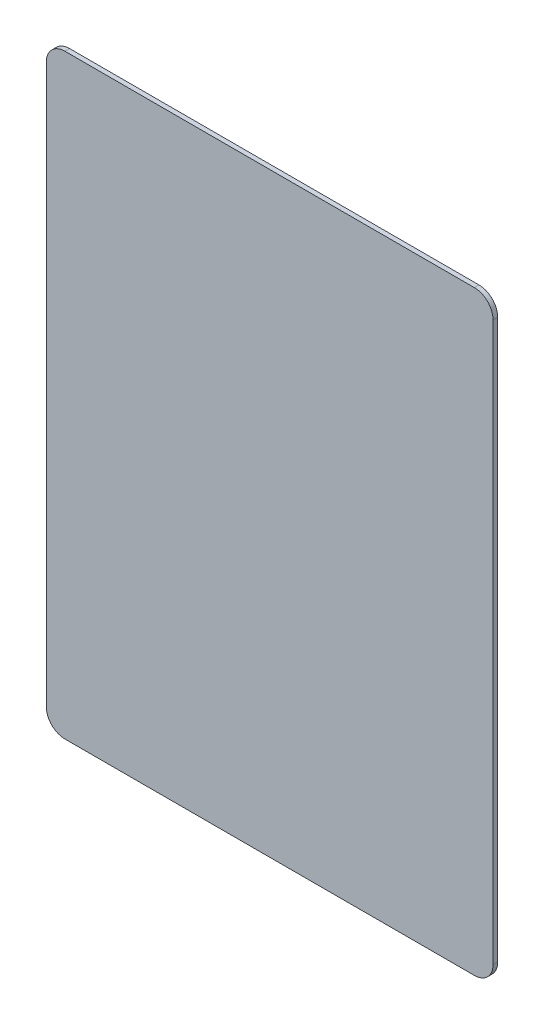
ISO-10303-21;
HEADER;
FILE_DESCRIPTION(('STEP AP214'),'2;1');
FILE_NAME('part.step','',(''),(''),'','','');
FILE_SCHEMA(('AUTOMOTIVE_DESIGN { 1 0 10303 214 1 1 1 1 }'));
ENDSEC;
DATA;
#1=APPLICATION_CONTEXT('core data for automotive mechanical design processes');
#2=APPLICATION_PROTOCOL_DEFINITION('international standard','automotive_design',2000,#1);
#3=PRODUCT_CONTEXT('',#1,'mechanical');
#4=PRODUCT('Part','Part','',(#3));
#5=PRODUCT_RELATED_PRODUCT_CATEGORY('part','',(#4));
#6=PRODUCT_DEFINITION_FORMATION('','',#4);
#7=PRODUCT_DEFINITION_CONTEXT('part definition',#1,'design');
#8=PRODUCT_DEFINITION('design','',#6,#7);
#9=PRODUCT_DEFINITION_SHAPE('','',#8);
#10=(LENGTH_UNIT() NAMED_UNIT(*) SI_UNIT(.MILLI.,.METRE.));
#11=(NAMED_UNIT(*) PLANE_ANGLE_UNIT() SI_UNIT($,.RADIAN.));
#12=(NAMED_UNIT(*) SI_UNIT($,.STERADIAN.) SOLID_ANGLE_UNIT());
#13=UNCERTAINTY_MEASURE_WITH_UNIT(LENGTH_MEASURE(1.E-05),#10,'distance_accuracy_value','');
#14=(GEOMETRIC_REPRESENTATION_CONTEXT(3) GLOBAL_UNCERTAINTY_ASSIGNED_CONTEXT((#13)) GLOBAL_UNIT_ASSIGNED_CONTEXT((#10,
#11,#12)) REPRESENTATION_CONTEXT('',''));
#15=CARTESIAN_POINT('',(0.,0.,0.));
#16=DIRECTION('',(0.,0.,1.));
#17=DIRECTION('',(1.,0.,0.));
#18=AXIS2_PLACEMENT_3D('',#15,#16,#17);
#19=CARTESIAN_POINT('',(-47.4869565217391,157.783695652174,1.5875));
#20=DIRECTION('',(0.,0.,-1.));
#21=DIRECTION('',(-1.,0.,0.));
#22=AXIS2_PLACEMENT_3D('',#19,#20,#21);
#23=CYLINDRICAL_SURFACE('',#22,6.35);
#24=CARTESIAN_POINT('',(-47.4869565217391,157.783695652174,0.));
#25=DIRECTION('',(0.,0.,1.));
#26=DIRECTION('',(1.,0.,0.));
#27=AXIS2_PLACEMENT_3D('',#24,#25,#26);
#28=CIRCLE('',#27,6.35);
#29=CARTESIAN_POINT('',(-47.4869565217391,164.133695652174,0.));
#30=VERTEX_POINT('',#29);
#31=CARTESIAN_POINT('',(-53.8369565217391,157.783695652174,0.));
#32=VERTEX_POINT('',#31);
#33=EDGE_CURVE('E140',#30,#32,#28,.T.);
#34=ORIENTED_EDGE('',*,*,#33,.T.);
#35=DIRECTION('',(0.,0.,-1.));
#36=VECTOR('',#35,1.);
#37=CARTESIAN_POINT('',(-53.8369565217391,157.783695652174,1.5875));
#38=LINE('',#37,#36);
#39=CARTESIAN_POINT('',(-53.8369565217391,157.783695652174,1.5875));
#40=VERTEX_POINT('',#39);
#41=EDGE_CURVE('E11',#40,#32,#38,.T.);
#42=ORIENTED_EDGE('',*,*,#41,.F.);
#43=CARTESIAN_POINT('',(-47.4869565217391,157.783695652174,1.5875));
#44=DIRECTION('',(0.,0.,1.));
#45=DIRECTION('',(1.,0.,0.));
#46=AXIS2_PLACEMENT_3D('',#43,#44,#45);
#47=CIRCLE('',#46,6.35);
#48=CARTESIAN_POINT('',(-47.4869565217391,164.133695652174,1.5875));
#49=VERTEX_POINT('',#48);
#50=EDGE_CURVE('E162',#49,#40,#47,.T.);
#51=ORIENTED_EDGE('',*,*,#50,.F.);
#52=DIRECTION('',(0.,0.,-1.));
#53=VECTOR('',#52,1.);
#54=CARTESIAN_POINT('',(-47.4869565217391,164.133695652174,1.5875));
#55=LINE('',#54,#53);
#56=EDGE_CURVE('E136',#49,#30,#55,.T.);
#57=ORIENTED_EDGE('',*,*,#56,.T.);
#58=EDGE_LOOP('',(#34,#42,#51,#57));
#59=FACE_BOUND('',#58,.T.);
#60=ADVANCED_FACE('F39',(#59),#23,.T.);
#61=CARTESIAN_POINT('',(-53.8369565217391,157.783695652174,1.5875));
#62=DIRECTION('',(1.,0.,0.));
#63=DIRECTION('',(0.,1.,0.));
#64=AXIS2_PLACEMENT_3D('',#61,#62,#63);
#65=PLANE('',#64);
#66=DIRECTION('',(0.,-1.,0.));
#67=VECTOR('',#66,1.);
#68=CARTESIAN_POINT('',(-53.8369565217391,157.783695652174,0.));
#69=LINE('',#68,#67);
#70=CARTESIAN_POINT('',(-53.8369565217391,-32.716304347826,0.));
#71=VERTEX_POINT('',#70);
#72=EDGE_CURVE('E144',#32,#71,#69,.T.);
#73=ORIENTED_EDGE('',*,*,#72,.T.);
#74=DIRECTION('',(0.,0.,-1.));
#75=VECTOR('',#74,1.);
#76=CARTESIAN_POINT('',(-53.8369565217391,-32.716304347826,1.5875));
#77=LINE('',#76,#75);
#78=CARTESIAN_POINT('',(-53.8369565217391,-32.716304347826,1.5875));
#79=VERTEX_POINT('',#78);
#80=EDGE_CURVE('E48',#79,#71,#77,.T.);
#81=ORIENTED_EDGE('',*,*,#80,.F.);
#82=DIRECTION('',(0.,-1.,0.));
#83=VECTOR('',#82,1.);
#84=CARTESIAN_POINT('',(-53.8369565217391,157.783695652174,1.5875));
#85=LINE('',#84,#83);
#86=EDGE_CURVE('E99',#40,#79,#85,.T.);
#87=ORIENTED_EDGE('',*,*,#86,.F.);
#88=ORIENTED_EDGE('',*,*,#41,.T.);
#89=EDGE_LOOP('',(#73,#81,#87,#88));
#90=FACE_BOUND('',#89,.T.);
#91=ADVANCED_FACE('F208',(#90),#65,.F.);
#92=CARTESIAN_POINT('',(-47.4869565217391,-32.7163043478261,1.5875));
#93=DIRECTION('',(0.,0.,-1.));
#94=DIRECTION('',(-1.,0.,0.));
#95=AXIS2_PLACEMENT_3D('',#92,#93,#94);
#96=CYLINDRICAL_SURFACE('',#95,6.35);
#97=CARTESIAN_POINT('',(-47.4869565217391,-32.7163043478261,0.));
#98=DIRECTION('',(0.,0.,1.));
#99=DIRECTION('',(1.,0.,0.));
#100=AXIS2_PLACEMENT_3D('',#97,#98,#99);
#101=CIRCLE('',#100,6.35);
#102=CARTESIAN_POINT('',(-47.4869565217391,-39.0663043478261,0.));
#103=VERTEX_POINT('',#102);
#104=EDGE_CURVE('E147',#71,#103,#101,.T.);
#105=ORIENTED_EDGE('',*,*,#104,.T.);
#106=DIRECTION('',(0.,0.,-1.));
#107=VECTOR('',#106,1.);
#108=CARTESIAN_POINT('',(-47.4869565217391,-39.0663043478261,1.5875));
#109=LINE('',#108,#107);
#110=CARTESIAN_POINT('',(-47.4869565217391,-39.0663043478261,1.5875));
#111=VERTEX_POINT('',#110);
#112=EDGE_CURVE('E173',#111,#103,#109,.T.);
#113=ORIENTED_EDGE('',*,*,#112,.F.);
#114=CARTESIAN_POINT('',(-47.4869565217391,-32.7163043478261,1.5875));
#115=DIRECTION('',(0.,0.,1.));
#116=DIRECTION('',(1.,0.,0.));
#117=AXIS2_PLACEMENT_3D('',#114,#115,#116);
#118=CIRCLE('',#117,6.35);
#119=EDGE_CURVE('E183',#79,#111,#118,.T.);
#120=ORIENTED_EDGE('',*,*,#119,.F.);
#121=ORIENTED_EDGE('',*,*,#80,.T.);
#122=EDGE_LOOP('',(#105,#113,#120,#121));
#123=FACE_BOUND('',#122,.T.);
#124=ADVANCED_FACE('F181',(#123),#96,.T.);
#125=CARTESIAN_POINT('',(-47.4869565217391,-39.0663043478261,1.5875));
#126=DIRECTION('',(0.,1.,0.));
#127=DIRECTION('',(0.,0.,1.));
#128=AXIS2_PLACEMENT_3D('',#125,#126,#127);
#129=PLANE('',#128);
#130=DIRECTION('',(1.,0.,0.));
#131=VECTOR('',#130,1.);
#132=CARTESIAN_POINT('',(-47.4869565217391,-39.0663043478261,0.));
#133=LINE('',#132,#131);
#134=CARTESIAN_POINT('',(92.2130434782608,-39.0663043478261,0.));
#135=VERTEX_POINT('',#134);
#136=EDGE_CURVE('E150',#103,#135,#133,.T.);
#137=ORIENTED_EDGE('',*,*,#136,.T.);
#138=DIRECTION('',(0.,0.,-1.));
#139=VECTOR('',#138,1.);
#140=CARTESIAN_POINT('',(92.2130434782608,-39.0663043478261,1.5875));
#141=LINE('',#140,#139);
#142=CARTESIAN_POINT('',(92.2130434782608,-39.0663043478261,1.5875));
#143=VERTEX_POINT('',#142);
#144=EDGE_CURVE('E169',#143,#135,#141,.T.);
#145=ORIENTED_EDGE('',*,*,#144,.F.);
#146=DIRECTION('',(1.,0.,0.));
#147=VECTOR('',#146,1.);
#148=CARTESIAN_POINT('',(-47.4869565217391,-39.0663043478261,1.5875));
#149=LINE('',#148,#147);
#150=EDGE_CURVE('E196',#111,#143,#149,.T.);
#151=ORIENTED_EDGE('',*,*,#150,.F.);
#152=ORIENTED_EDGE('',*,*,#112,.T.);
#153=EDGE_LOOP('',(#137,#145,#151,#152));
#154=FACE_BOUND('',#153,.T.);
#155=ADVANCED_FACE('F191',(#154),#129,.F.);
#156=CARTESIAN_POINT('',(92.2130434782609,-32.7163043478261,1.5875));
#157=DIRECTION('',(0.,0.,-1.));
#158=DIRECTION('',(-1.,0.,0.));
#159=AXIS2_PLACEMENT_3D('',#156,#157,#158);
#160=CYLINDRICAL_SURFACE('',#159,6.35);
#161=CARTESIAN_POINT('',(92.2130434782609,-32.7163043478261,0.));
#162=DIRECTION('',(0.,0.,1.));
#163=DIRECTION('',(1.,0.,0.));
#164=AXIS2_PLACEMENT_3D('',#161,#162,#163);
#165=CIRCLE('',#164,6.35);
#166=CARTESIAN_POINT('',(98.5630434782609,-32.716304347826,0.));
#167=VERTEX_POINT('',#166);
#168=EDGE_CURVE('E153',#135,#167,#165,.T.);
#169=ORIENTED_EDGE('',*,*,#168,.T.);
#170=DIRECTION('',(0.,0.,-1.));
#171=VECTOR('',#170,1.);
#172=CARTESIAN_POINT('',(98.5630434782609,-32.716304347826,1.5875));
#173=LINE('',#172,#171);
#174=CARTESIAN_POINT('',(98.5630434782609,-32.716304347826,1.5875));
#175=VERTEX_POINT('',#174);
#176=EDGE_CURVE('E129',#175,#167,#173,.T.);
#177=ORIENTED_EDGE('',*,*,#176,.F.);
#178=CARTESIAN_POINT('',(92.2130434782609,-32.7163043478261,1.5875));
#179=DIRECTION('',(0.,0.,1.));
#180=DIRECTION('',(1.,0.,0.));
#181=AXIS2_PLACEMENT_3D('',#178,#179,#180);
#182=CIRCLE('',#181,6.35);
#183=EDGE_CURVE('E118',#143,#175,#182,.T.);
#184=ORIENTED_EDGE('',*,*,#183,.F.);
#185=ORIENTED_EDGE('',*,*,#144,.T.);
#186=EDGE_LOOP('',(#169,#177,#184,#185));
#187=FACE_BOUND('',#186,.T.);
#188=ADVANCED_FACE('F194',(#187),#160,.T.);
#189=CARTESIAN_POINT('',(98.5630434782609,157.783695652174,1.5875));
#190=DIRECTION('',(-1.,0.,0.));
#191=DIRECTION('',(0.,-1.,0.));
#192=AXIS2_PLACEMENT_3D('',#189,#190,#191);
#193=PLANE('',#192);
#194=DIRECTION('',(0.,1.,0.));
#195=VECTOR('',#194,1.);
#196=CARTESIAN_POINT('',(98.5630434782609,157.783695652174,0.));
#197=LINE('',#196,#195);
#198=CARTESIAN_POINT('',(98.5630434782609,157.783695652174,0.));
#199=VERTEX_POINT('',#198);
#200=EDGE_CURVE('E127',#167,#199,#197,.T.);
#201=ORIENTED_EDGE('',*,*,#200,.T.);
#202=DIRECTION('',(0.,0.,-1.));
#203=VECTOR('',#202,1.);
#204=CARTESIAN_POINT('',(98.5630434782609,157.783695652174,1.5875));
#205=LINE('',#204,#203);
#206=CARTESIAN_POINT('',(98.5630434782609,157.783695652174,1.5875));
#207=VERTEX_POINT('',#206);
#208=EDGE_CURVE('E124',#207,#199,#205,.T.);
#209=ORIENTED_EDGE('',*,*,#208,.F.);
#210=DIRECTION('',(0.,1.,0.));
#211=VECTOR('',#210,1.);
#212=CARTESIAN_POINT('',(98.5630434782609,157.783695652174,1.5875));
#213=LINE('',#212,#211);
#214=EDGE_CURVE('E112',#175,#207,#213,.T.);
#215=ORIENTED_EDGE('',*,*,#214,.F.);
#216=ORIENTED_EDGE('',*,*,#176,.T.);
#217=EDGE_LOOP('',(#201,#209,#215,#216));
#218=FACE_BOUND('',#217,.T.);
#219=ADVANCED_FACE('F125',(#218),#193,.F.);
#220=CARTESIAN_POINT('',(92.2130434782609,157.783695652174,1.5875));
#221=DIRECTION('',(0.,0.,-1.));
#222=DIRECTION('',(-1.,0.,0.));
#223=AXIS2_PLACEMENT_3D('',#220,#221,#222);
#224=CYLINDRICAL_SURFACE('',#223,6.34999999999999);
#225=CARTESIAN_POINT('',(92.2130434782609,157.783695652174,0.));
#226=DIRECTION('',(0.,0.,1.));
#227=DIRECTION('',(-1.,0.,0.));
#228=AXIS2_PLACEMENT_3D('',#225,#226,#227);
#229=CIRCLE('',#228,6.34999999999999);
#230=CARTESIAN_POINT('',(92.2130434782608,164.133695652174,0.));
#231=VERTEX_POINT('',#230);
#232=EDGE_CURVE('E85',#199,#231,#229,.T.);
#233=ORIENTED_EDGE('',*,*,#232,.T.);
#234=DIRECTION('',(0.,0.,-1.));
#235=VECTOR('',#234,1.);
#236=CARTESIAN_POINT('',(92.2130434782608,164.133695652174,1.5875));
#237=LINE('',#236,#235);
#238=CARTESIAN_POINT('',(92.2130434782608,164.133695652174,1.5875));
#239=VERTEX_POINT('',#238);
#240=EDGE_CURVE('E130',#239,#231,#237,.T.);
#241=ORIENTED_EDGE('',*,*,#240,.F.);
#242=CARTESIAN_POINT('',(92.2130434782609,157.783695652174,1.5875));
#243=DIRECTION('',(0.,0.,1.));
#244=DIRECTION('',(-1.,0.,0.));
#245=AXIS2_PLACEMENT_3D('',#242,#243,#244);
#246=CIRCLE('',#245,6.34999999999999);
#247=EDGE_CURVE('E116',#207,#239,#246,.T.);
#248=ORIENTED_EDGE('',*,*,#247,.F.);
#249=ORIENTED_EDGE('',*,*,#208,.T.);
#250=EDGE_LOOP('',(#233,#241,#248,#249));
#251=FACE_BOUND('',#250,.T.);
#252=ADVANCED_FACE('F132',(#251),#224,.T.);
#253=CARTESIAN_POINT('',(-47.4869565217391,164.133695652174,1.5875));
#254=DIRECTION('',(0.,-1.,0.));
#255=DIRECTION('',(0.,0.,-1.));
#256=AXIS2_PLACEMENT_3D('',#253,#254,#255);
#257=PLANE('',#256);
#258=DIRECTION('',(-1.,0.,0.));
#259=VECTOR('',#258,1.);
#260=CARTESIAN_POINT('',(-47.4869565217391,164.133695652174,0.));
#261=LINE('',#260,#259);
#262=EDGE_CURVE('E91',#231,#30,#261,.T.);
#263=ORIENTED_EDGE('',*,*,#262,.T.);
#264=ORIENTED_EDGE('',*,*,#56,.F.);
#265=DIRECTION('',(-1.,0.,0.));
#266=VECTOR('',#265,1.);
#267=CARTESIAN_POINT('',(-47.4869565217391,164.133695652174,1.5875));
#268=LINE('',#267,#266);
#269=EDGE_CURVE('E56',#239,#49,#268,.T.);
#270=ORIENTED_EDGE('',*,*,#269,.F.);
#271=ORIENTED_EDGE('',*,*,#240,.T.);
#272=EDGE_LOOP('',(#263,#264,#270,#271));
#273=FACE_BOUND('',#272,.T.);
#274=ADVANCED_FACE('F224',(#273),#257,.F.);
#275=CARTESIAN_POINT('',(-47.4869565217391,157.783695652174,1.5875));
#276=DIRECTION('',(0.,0.,1.));
#277=DIRECTION('',(1.,0.,0.));
#278=AXIS2_PLACEMENT_3D('',#275,#276,#277);
#279=PLANE('',#278);
#280=ORIENTED_EDGE('',*,*,#50,.T.);
#281=ORIENTED_EDGE('',*,*,#86,.T.);
#282=ORIENTED_EDGE('',*,*,#119,.T.);
#283=ORIENTED_EDGE('',*,*,#150,.T.);
#284=ORIENTED_EDGE('',*,*,#183,.T.);
#285=ORIENTED_EDGE('',*,*,#214,.T.);
#286=ORIENTED_EDGE('',*,*,#247,.T.);
#287=ORIENTED_EDGE('',*,*,#269,.T.);
#288=EDGE_LOOP('',(#280,#281,#282,#283,#284,#285,#286,#287));
#289=FACE_BOUND('',#288,.T.);
#290=ADVANCED_FACE('F114',(#289),#279,.T.);
#291=CARTESIAN_POINT('',(-47.4869565217391,157.783695652174,0.));
#292=DIRECTION('',(0.,0.,1.));
#293=DIRECTION('',(1.,0.,0.));
#294=AXIS2_PLACEMENT_3D('',#291,#292,#293);
#295=PLANE('',#294);
#296=ORIENTED_EDGE('',*,*,#33,.F.);
#297=ORIENTED_EDGE('',*,*,#262,.F.);
#298=ORIENTED_EDGE('',*,*,#232,.F.);
#299=ORIENTED_EDGE('',*,*,#200,.F.);
#300=ORIENTED_EDGE('',*,*,#168,.F.);
#301=ORIENTED_EDGE('',*,*,#136,.F.);
#302=ORIENTED_EDGE('',*,*,#104,.F.);
#303=ORIENTED_EDGE('',*,*,#72,.F.);
#304=EDGE_LOOP('',(#296,#297,#298,#299,#300,#301,#302,#303));
#305=FACE_BOUND('',#304,.T.);
#306=ADVANCED_FACE('F187',(#305),#295,.F.);
#307=CLOSED_SHELL('',(#60,#91,#124,#155,#188,#219,#252,#274,#290,#306));
#308=MANIFOLD_SOLID_BREP('B2',#307);
#309=ADVANCED_BREP_SHAPE_REPRESENTATION('',(#18,#308),#14);
#310=SHAPE_DEFINITION_REPRESENTATION(#9,#309);
ENDSEC;
END-ISO-10303-21;
